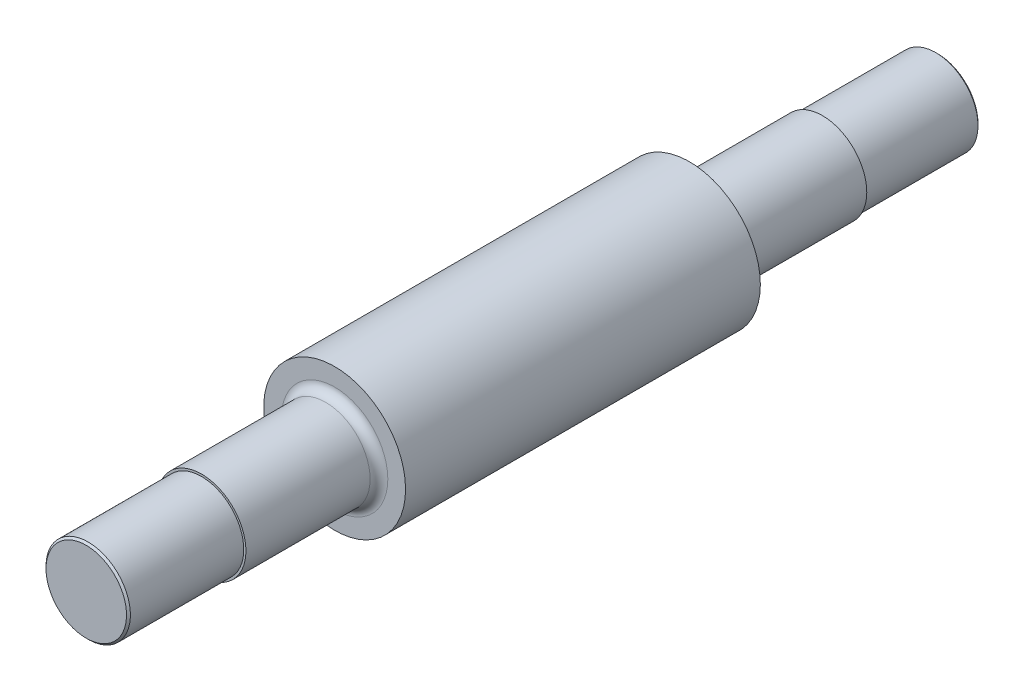
ISO-10303-21;
HEADER;
FILE_DESCRIPTION(('STEP AP214'),'2;1');
FILE_NAME('part.step','',(''),(''),'','','');
FILE_SCHEMA(('AUTOMOTIVE_DESIGN { 1 0 10303 214 1 1 1 1 }'));
ENDSEC;
DATA;
#1=APPLICATION_CONTEXT('core data for automotive mechanical design processes');
#2=APPLICATION_PROTOCOL_DEFINITION('international standard','automotive_design',2000,#1);
#3=PRODUCT_CONTEXT('',#1,'mechanical');
#4=PRODUCT('Part','Part','',(#3));
#5=PRODUCT_RELATED_PRODUCT_CATEGORY('part','',(#4));
#6=PRODUCT_DEFINITION_FORMATION('','',#4);
#7=PRODUCT_DEFINITION_CONTEXT('part definition',#1,'design');
#8=PRODUCT_DEFINITION('design','',#6,#7);
#9=PRODUCT_DEFINITION_SHAPE('','',#8);
#10=(LENGTH_UNIT() NAMED_UNIT(*) SI_UNIT(.MILLI.,.METRE.));
#11=(NAMED_UNIT(*) PLANE_ANGLE_UNIT() SI_UNIT($,.RADIAN.));
#12=(NAMED_UNIT(*) SI_UNIT($,.STERADIAN.) SOLID_ANGLE_UNIT());
#13=UNCERTAINTY_MEASURE_WITH_UNIT(LENGTH_MEASURE(1.E-05),#10,'distance_accuracy_value','');
#14=(GEOMETRIC_REPRESENTATION_CONTEXT(3) GLOBAL_UNCERTAINTY_ASSIGNED_CONTEXT((#13)) GLOBAL_UNIT_ASSIGNED_CONTEXT((#10,
#11,#12)) REPRESENTATION_CONTEXT('',''));
#15=CARTESIAN_POINT('',(0.,0.,0.));
#16=DIRECTION('',(0.,0.,1.));
#17=DIRECTION('',(1.,0.,0.));
#18=AXIS2_PLACEMENT_3D('',#15,#16,#17);
#19=CARTESIAN_POINT('',(0.,0.,-28.));
#20=DIRECTION('',(0.,0.,1.));
#21=DIRECTION('',(1.,0.,0.));
#22=AXIS2_PLACEMENT_3D('',#19,#20,#21);
#23=CYLINDRICAL_SURFACE('',#22,5.);
#24=CARTESIAN_POINT('',(0.,0.,-15.));
#25=DIRECTION('',(0.,0.,1.));
#26=DIRECTION('',(1.,0.,0.));
#27=AXIS2_PLACEMENT_3D('',#24,#25,#26);
#28=CIRCLE('',#27,5.);
#29=CARTESIAN_POINT('',(5.,0.,-15.));
#30=VERTEX_POINT('',#29);
#31=EDGE_CURVE('E232',#30,#30,#28,.T.);
#32=ORIENTED_EDGE('',*,*,#31,.T.);
#33=EDGE_LOOP('',(#32));
#34=FACE_BOUND('',#33,.T.);
#35=CARTESIAN_POINT('',(-4.58257569495584,2.,-3.));
#36=CARTESIAN_POINT('',(-4.58256464470381,2.00000798036348,-2.94619414749741));
#37=CARTESIAN_POINT('',(-4.58352306077322,1.99782891366025,-2.89239433444236));
#38=CARTESIAN_POINT('',(-4.58729625417543,1.98915905973447,-2.7852287017453));
#39=CARTESIAN_POINT('',(-4.59011032448545,1.98266991468793,-2.73186272464398));
#40=CARTESIAN_POINT('',(-4.59749782920639,1.9654760367637,-2.62615317844122));
#41=CARTESIAN_POINT('',(-4.60206430717532,1.95478796820434,-2.57380641595598));
#42=CARTESIAN_POINT('',(-4.61280053296682,1.92931630190661,-2.47029922828555));
#43=CARTESIAN_POINT('',(-4.61897037865398,1.91453245417091,-2.41913887572284));
#44=CARTESIAN_POINT('',(-4.63959291248421,1.86426971793523,-2.26806414941804));
#45=CARTESIAN_POINT('',(-4.6561744915743,1.82284489460008,-2.17034576931025));
#46=CARTESIAN_POINT('',(-4.6931237076538,1.72548191592177,-1.98320441991737));
#47=CARTESIAN_POINT('',(-4.71349493864007,1.66952996336926,-1.89378944703834));
#48=CARTESIAN_POINT('',(-4.75700999402114,1.54131835736855,-1.72073760332577));
#49=CARTESIAN_POINT('',(-4.78024245635516,1.4683691399273,-1.63763278307977));
#50=CARTESIAN_POINT('',(-4.82612790548655,1.30969646176209,-1.48445972778927));
#51=CARTESIAN_POINT('',(-4.84878077249721,1.22397038499682,-1.41439416913425));
#52=CARTESIAN_POINT('',(-4.89203417106082,1.03800590808969,-1.28659360580435));
#53=CARTESIAN_POINT('',(-4.91251824543531,0.937327933050965,-1.22945519073807));
#54=CARTESIAN_POINT('',(-4.94803944125003,0.726824143246712,-1.13315592731136));
#55=CARTESIAN_POINT('',(-4.96307883544185,0.617002169026247,-1.09398757594833));
#56=CARTESIAN_POINT('',(-4.98538314653815,0.396967441295693,-1.03665879868943));
#57=CARTESIAN_POINT('',(-4.99298922547927,0.287031054523062,-1.01757304909434));
#58=CARTESIAN_POINT('',(-5.00080310201085,0.0652684304565179,-0.997971520054384));
#59=CARTESIAN_POINT('',(-5.0010135205303,-0.046557123284163,-0.997449161976468));
#60=CARTESIAN_POINT('',(-4.99421960045302,-0.262233376226782,-1.01448283915987));
#61=CARTESIAN_POINT('',(-4.98761985585461,-0.36617920250679,-1.03102504667401));
#62=CARTESIAN_POINT('',(-4.96849270441446,-0.569674786500928,-1.07999342705354));
#63=CARTESIAN_POINT('',(-4.95596496209929,-0.66922429507284,-1.11242049886861));
#64=CARTESIAN_POINT('',(-4.92596830598785,-0.862897539070293,-1.19263629642451));
#65=CARTESIAN_POINT('',(-4.90842774755848,-0.956916851366439,-1.24064924081046));
#66=CARTESIAN_POINT('',(-4.87014602008043,-1.13580746919776,-1.35046458859515));
#67=CARTESIAN_POINT('',(-4.84940372896448,-1.22067554984697,-1.41227182969058));
#68=CARTESIAN_POINT('',(-4.80521782746143,-1.38476339273627,-1.55264418025852));
#69=CARTESIAN_POINT('',(-4.78168627172884,-1.4632477030894,-1.63204247467003));
#70=CARTESIAN_POINT('',(-4.7356195058465,-1.60609926099478,-1.80298009514767));
#71=CARTESIAN_POINT('',(-4.71308475332783,-1.67046007709005,-1.89452492209426));
#72=CARTESIAN_POINT('',(-4.67095688856025,-1.78493657933605,-2.09047028402122));
#73=CARTESIAN_POINT('',(-4.65146702150583,-1.83458932217622,-2.19516483666021));
#74=CARTESIAN_POINT('',(-4.61886105059581,-1.91521298357264,-2.41236152442947));
#75=CARTESIAN_POINT('',(-4.60573367628738,-1.94621696002208,-2.52484944733829));
#76=CARTESIAN_POINT('',(-4.59208303529493,-1.9781058182572,-2.69874363415798));
#77=CARTESIAN_POINT('',(-4.58853437680526,-1.98630505165979,-2.75865754930133));
#78=CARTESIAN_POINT('',(-4.58377540314389,-1.99725282103812,-2.87903501899554));
#79=CARTESIAN_POINT('',(-4.58256364711745,-2.00000471568568,-2.93949821175783));
#80=CARTESIAN_POINT('',(-4.58257569495584,-2.,-3.));
#81=B_SPLINE_CURVE_WITH_KNOTS('',3,(#35,#36,#37,#38,#39,#40,#41,#42,#43,#44,#45,#46,#47,#48,#49,
#50,#51,#52,#53,#54,#55,#56,#57,#58,#59,#60,#61,#62,#63,#64,#65,#66,#67,#68,#69,#70,#71,#72,#73,
#74,#75,#76,#77,#78,#79,#80),.UNSPECIFIED.,.F.,.F.,(4,2,2,2,2,2,2,2,2,2,2,2,2,2,2,2,2,2,2,2,2,2,
4),(0.,0.161354853098823,0.322648263883206,0.483307911251879,0.643977367092303,
0.964683001739095,1.28569434942626,1.62318047995499,1.96073580539192,2.31162858925764,
2.66237473197323,2.9961387650427,3.32978451514656,3.64468915259535,3.95961161305655,
4.27928176927547,4.59906421133019,4.93981874675154,5.28072813203934,5.63144241548463,
5.98153315592125,6.16300192557814,6.34435877193561),.UNSPECIFIED.);
#82=CARTESIAN_POINT('',(-5.00000000000041,0.,-0.999999999998974));
#83=VERTEX_POINT('',#82);
#84=CARTESIAN_POINT('',(-4.58257569495584,-2.,-3.));
#85=VERTEX_POINT('',#84);
#86=EDGE_CURVE('E305',#83,#85,#81,.T.);
#87=ORIENTED_EDGE('',*,*,#86,.T.);
#88=DIRECTION('',(0.,0.,-1.));
#89=VECTOR('',#88,1.);
#90=CARTESIAN_POINT('',(-4.58257569495584,-2.,68.));
#91=LINE('',#90,#89);
#92=CARTESIAN_POINT('',(-4.58257569495584,-2.,-9.49999999999999));
#93=VERTEX_POINT('',#92);
#94=EDGE_CURVE('E126',#85,#93,#91,.T.);
#95=ORIENTED_EDGE('',*,*,#94,.T.);
#96=CARTESIAN_POINT('',(-4.58257569495584,-2.,-9.49999999999999));
#97=CARTESIAN_POINT('',(-4.58256464470381,-2.00000798036347,-9.55380585250259));
#98=CARTESIAN_POINT('',(-4.58352306077323,-1.99782891366025,-9.60760566555764));
#99=CARTESIAN_POINT('',(-4.58729625417543,-1.98915905973447,-9.7147712982547));
#100=CARTESIAN_POINT('',(-4.59011032448545,-1.98266991468792,-9.76813727535603));
#101=CARTESIAN_POINT('',(-4.59749782920639,-1.9654760367637,-9.87384682155879));
#102=CARTESIAN_POINT('',(-4.60206430717533,-1.95478796820434,-9.92619358404403));
#103=CARTESIAN_POINT('',(-4.61280053296682,-1.9293163019066,-10.0297007717145));
#104=CARTESIAN_POINT('',(-4.61897037865398,-1.9145324541709,-10.0808611242772));
#105=CARTESIAN_POINT('',(-4.63959291248421,-1.86426971793523,-10.231935850582));
#106=CARTESIAN_POINT('',(-4.6561744915743,-1.82284489460008,-10.3296542306898));
#107=CARTESIAN_POINT('',(-4.6931237076538,-1.72548191592176,-10.5167955800826));
#108=CARTESIAN_POINT('',(-4.71349493864007,-1.66952996336925,-10.6062105529617));
#109=CARTESIAN_POINT('',(-4.75700999402114,-1.54131835736854,-10.7792623966742));
#110=CARTESIAN_POINT('',(-4.78024245635516,-1.4683691399273,-10.8623672169202));
#111=CARTESIAN_POINT('',(-4.82612790548656,-1.30969646176208,-11.0155402722107));
#112=CARTESIAN_POINT('',(-4.84878077249721,-1.22397038499682,-11.0856058308657));
#113=CARTESIAN_POINT('',(-4.89203417106082,-1.03800590808969,-11.2134063941957));
#114=CARTESIAN_POINT('',(-4.91251824543531,-0.937327933050958,-11.2705448092619));
#115=CARTESIAN_POINT('',(-4.94803944125004,-0.726824143246706,-11.3668440726886));
#116=CARTESIAN_POINT('',(-4.96307883544185,-0.617002169026242,-11.4060124240517));
#117=CARTESIAN_POINT('',(-4.98538314653816,-0.39696744129569,-11.4633412013106));
#118=CARTESIAN_POINT('',(-4.99298922547927,-0.287031054523057,-11.4824269509057));
#119=CARTESIAN_POINT('',(-5.00080310201085,-0.0652684304565126,-11.5020284799456));
#120=CARTESIAN_POINT('',(-5.00101352053029,0.0465571232841679,-11.5025508380235));
#121=CARTESIAN_POINT('',(-4.99421960045302,0.262233376226784,-11.4855171608401));
#122=CARTESIAN_POINT('',(-4.98761985585461,0.366179202506789,-11.468974953326));
#123=CARTESIAN_POINT('',(-4.96849270441446,0.569674786500929,-11.4200065729465));
#124=CARTESIAN_POINT('',(-4.95596496209929,0.669224295072845,-11.3875795011314));
#125=CARTESIAN_POINT('',(-4.92596830598785,0.862897539070297,-11.3073637035755));
#126=CARTESIAN_POINT('',(-4.90842774755848,0.956916851366436,-11.2593507591895));
#127=CARTESIAN_POINT('',(-4.87014602008043,1.13580746919776,-11.1495354114048));
#128=CARTESIAN_POINT('',(-4.84940372896448,1.22067554984698,-11.0877281703094));
#129=CARTESIAN_POINT('',(-4.80521782746143,1.38476339273627,-10.9473558197415));
#130=CARTESIAN_POINT('',(-4.78168627172885,1.46324770308939,-10.86795752533));
#131=CARTESIAN_POINT('',(-4.7356195058465,1.60609926099478,-10.6970199048523));
#132=CARTESIAN_POINT('',(-4.71308475332783,1.67046007709006,-10.6054750779057));
#133=CARTESIAN_POINT('',(-4.67095688856024,1.78493657933606,-10.4095297159788));
#134=CARTESIAN_POINT('',(-4.65146702150583,1.83458932217622,-10.3048351633398));
#135=CARTESIAN_POINT('',(-4.61886105059581,1.91521298357264,-10.0876384755705));
#136=CARTESIAN_POINT('',(-4.60573367628738,1.94621696002208,-9.97515055266171));
#137=CARTESIAN_POINT('',(-4.59208303529492,1.9781058182572,-9.80125636584202));
#138=CARTESIAN_POINT('',(-4.58853437680526,1.9863050516598,-9.74134245069867));
#139=CARTESIAN_POINT('',(-4.58377540314388,1.99725282103812,-9.62096498100446));
#140=CARTESIAN_POINT('',(-4.58256364711744,2.00000471568568,-9.56050178824217));
#141=CARTESIAN_POINT('',(-4.58257569495584,2.,-9.49999999999999));
#142=B_SPLINE_CURVE_WITH_KNOTS('',3,(#96,#97,#98,#99,#100,#101,#102,#103,#104,#105,#106,#107,
#108,#109,#110,#111,#112,#113,#114,#115,#116,#117,#118,#119,#120,#121,#122,#123,#124,#125,#126,
#127,#128,#129,#130,#131,#132,#133,#134,#135,#136,#137,#138,#139,#140,#141),.UNSPECIFIED.,.F.,
.F.,(4,2,2,2,2,2,2,2,2,2,2,2,2,2,2,2,2,2,2,2,2,2,4),(0.,0.161354853098826,0.322648263883215,
0.48330791125189,0.643977367092316,0.964683001739101,1.28569434942626,1.62318047995499,
1.96073580539192,2.31162858925764,2.66237473197323,2.9961387650427,3.32978451514656,
3.64468915259536,3.95961161305655,4.27928176927547,4.59906421133019,4.93981874675153,
5.28072813203934,5.63144241548463,5.98153315592126,6.16300192557815,6.34435877193562),.UNSPECIFIED.);
#143=CARTESIAN_POINT('',(-4.58257569495584,2.,-9.49999999999999));
#144=VERTEX_POINT('',#143);
#145=EDGE_CURVE('E162',#93,#144,#142,.T.);
#146=ORIENTED_EDGE('',*,*,#145,.T.);
#147=DIRECTION('',(0.,0.,-1.));
#148=VECTOR('',#147,1.);
#149=CARTESIAN_POINT('',(-4.58257569495584,2.,68.));
#150=LINE('',#149,#148);
#151=CARTESIAN_POINT('',(-4.58257569495584,2.,-3.));
#152=VERTEX_POINT('',#151);
#153=EDGE_CURVE('E308',#144,#152,#150,.F.);
#154=ORIENTED_EDGE('',*,*,#153,.T.);
#155=EDGE_CURVE('E146',#152,#83,#81,.T.);
#156=ORIENTED_EDGE('',*,*,#155,.T.);
#157=CARTESIAN_POINT('',(0.,0.,-1.));
#158=DIRECTION('',(0.,0.,1.));
#159=DIRECTION('',(1.,0.,0.));
#160=AXIS2_PLACEMENT_3D('',#157,#158,#159);
#161=CIRCLE('',#160,5.);
#162=EDGE_CURVE('E247',#83,#83,#161,.F.);
#163=ORIENTED_EDGE('',*,*,#162,.T.);
#164=EDGE_LOOP('',(#87,#95,#146,#154,#156,#163));
#165=FACE_BOUND('',#164,.T.);
#166=ADVANCED_FACE('F51',(#34,#165),#23,.T.);
#167=CARTESIAN_POINT('',(0.,0.,40.));
#168=DIRECTION('',(0.,0.,-1.));
#169=DIRECTION('',(-1.,0.,0.));
#170=AXIS2_PLACEMENT_3D('',#167,#168,#169);
#171=CYLINDRICAL_SURFACE('',#170,8.);
#172=CARTESIAN_POINT('',(0.,0.,40.));
#173=DIRECTION('',(0.,0.,1.));
#174=DIRECTION('',(1.,0.,0.));
#175=AXIS2_PLACEMENT_3D('',#172,#173,#174);
#176=CIRCLE('',#175,8.);
#177=CARTESIAN_POINT('',(8.,0.,40.));
#178=VERTEX_POINT('',#177);
#179=EDGE_CURVE('E239',#178,#178,#176,.T.);
#180=ORIENTED_EDGE('',*,*,#179,.F.);
#181=EDGE_LOOP('',(#180));
#182=FACE_BOUND('',#181,.T.);
#183=CARTESIAN_POINT('',(0.,0.,0.));
#184=DIRECTION('',(0.,0.,1.));
#185=DIRECTION('',(1.,0.,0.));
#186=AXIS2_PLACEMENT_3D('',#183,#184,#185);
#187=CIRCLE('',#186,8.);
#188=CARTESIAN_POINT('',(8.,0.,0.));
#189=VERTEX_POINT('',#188);
#190=EDGE_CURVE('E238',#189,#189,#187,.T.);
#191=ORIENTED_EDGE('',*,*,#190,.T.);
#192=EDGE_LOOP('',(#191));
#193=FACE_BOUND('',#192,.T.);
#194=ADVANCED_FACE('F272',(#182,#193),#171,.T.);
#195=CARTESIAN_POINT('',(0.,0.,40.));
#196=DIRECTION('',(0.,0.,1.));
#197=DIRECTION('',(1.,0.,0.));
#198=AXIS2_PLACEMENT_3D('',#195,#196,#197);
#199=PLANE('',#198);
#200=CARTESIAN_POINT('',(0.,0.,40.));
#201=DIRECTION('',(0.,0.,1.));
#202=DIRECTION('',(1.,0.,0.));
#203=AXIS2_PLACEMENT_3D('',#200,#201,#202);
#204=CIRCLE('',#203,6.);
#205=CARTESIAN_POINT('',(6.,0.,40.));
#206=VERTEX_POINT('',#205);
#207=EDGE_CURVE('E13',#206,#206,#204,.F.);
#208=ORIENTED_EDGE('',*,*,#207,.T.);
#209=EDGE_LOOP('',(#208));
#210=FACE_BOUND('',#209,.T.);
#211=ORIENTED_EDGE('',*,*,#179,.T.);
#212=EDGE_LOOP('',(#211));
#213=FACE_BOUND('',#212,.T.);
#214=ADVANCED_FACE('F278',(#210,#213),#199,.T.);
#215=CARTESIAN_POINT('',(0.,0.,0.));
#216=DIRECTION('',(0.,0.,1.));
#217=DIRECTION('',(1.,0.,0.));
#218=AXIS2_PLACEMENT_3D('',#215,#216,#217);
#219=PLANE('',#218);
#220=CARTESIAN_POINT('',(0.,0.,0.));
#221=DIRECTION('',(0.,0.,1.));
#222=DIRECTION('',(1.,0.,0.));
#223=AXIS2_PLACEMENT_3D('',#220,#221,#222);
#224=CIRCLE('',#223,6.);
#225=CARTESIAN_POINT('',(6.,0.,0.));
#226=VERTEX_POINT('',#225);
#227=EDGE_CURVE('E242',#226,#226,#224,.T.);
#228=ORIENTED_EDGE('',*,*,#227,.T.);
#229=EDGE_LOOP('',(#228));
#230=FACE_BOUND('',#229,.T.);
#231=ORIENTED_EDGE('',*,*,#190,.F.);
#232=EDGE_LOOP('',(#231));
#233=FACE_BOUND('',#232,.T.);
#234=ADVANCED_FACE('F287',(#230,#233),#219,.F.);
#235=CARTESIAN_POINT('',(0.,0.,-1.));
#236=DIRECTION('',(0.,0.,1.));
#237=DIRECTION('',(1.,0.,0.));
#238=AXIS2_PLACEMENT_3D('',#235,#236,#237);
#239=TOROIDAL_SURFACE('',#238,6.,1.);
#240=ORIENTED_EDGE('',*,*,#162,.F.);
#241=EDGE_LOOP('',(#240));
#242=FACE_BOUND('',#241,.T.);
#243=ORIENTED_EDGE('',*,*,#227,.F.);
#244=EDGE_LOOP('',(#243));
#245=FACE_BOUND('',#244,.T.);
#246=ADVANCED_FACE('F284',(#242,#245),#239,.F.);
#247=CARTESIAN_POINT('',(0.,0.,-28.));
#248=DIRECTION('',(0.,0.,1.));
#249=DIRECTION('',(1.,0.,0.));
#250=AXIS2_PLACEMENT_3D('',#247,#248,#249);
#251=CYLINDRICAL_SURFACE('',#250,4.7565);
#252=CARTESIAN_POINT('',(0.,0.,-15.));
#253=DIRECTION('',(0.,0.,1.));
#254=DIRECTION('',(1.,0.,0.));
#255=AXIS2_PLACEMENT_3D('',#252,#253,#254);
#256=CIRCLE('',#255,4.7565);
#257=CARTESIAN_POINT('',(4.7565,0.,-15.));
#258=VERTEX_POINT('',#257);
#259=EDGE_CURVE('E235',#258,#258,#256,.T.);
#260=ORIENTED_EDGE('',*,*,#259,.F.);
#261=EDGE_LOOP('',(#260));
#262=FACE_BOUND('',#261,.T.);
#263=CARTESIAN_POINT('',(0.,0.,-27.7835));
#264=DIRECTION('',(0.,0.,1.));
#265=DIRECTION('',(1.,0.,0.));
#266=AXIS2_PLACEMENT_3D('',#263,#264,#265);
#267=CIRCLE('',#266,4.7565);
#268=CARTESIAN_POINT('',(4.7565,0.,-27.7835));
#269=VERTEX_POINT('',#268);
#270=EDGE_CURVE('E226',#269,#269,#267,.T.);
#271=ORIENTED_EDGE('',*,*,#270,.T.);
#272=EDGE_LOOP('',(#271));
#273=FACE_BOUND('',#272,.T.);
#274=ADVANCED_FACE('F286',(#262,#273),#251,.T.);
#275=CARTESIAN_POINT('',(4.7565,0.,-15.));
#276=DIRECTION('',(0.,0.,1.));
#277=DIRECTION('',(1.,0.,0.));
#278=AXIS2_PLACEMENT_3D('',#275,#276,#277);
#279=PLANE('',#278);
#280=ORIENTED_EDGE('',*,*,#31,.F.);
#281=EDGE_LOOP('',(#280));
#282=FACE_BOUND('',#281,.T.);
#283=ORIENTED_EDGE('',*,*,#259,.T.);
#284=EDGE_LOOP('',(#283));
#285=FACE_BOUND('',#284,.T.);
#286=ADVANCED_FACE('F293',(#282,#285),#279,.F.);
#287=CARTESIAN_POINT('',(0.,0.,-28.));
#288=DIRECTION('',(0.,0.,1.));
#289=DIRECTION('',(1.,0.,0.));
#290=AXIS2_PLACEMENT_3D('',#287,#288,#289);
#291=CONICAL_SURFACE('',#290,4.54,0.785398163397458);
#292=ORIENTED_EDGE('',*,*,#270,.F.);
#293=EDGE_LOOP('',(#292));
#294=FACE_BOUND('',#293,.T.);
#295=CARTESIAN_POINT('',(0.,0.,-28.));
#296=DIRECTION('',(0.,0.,1.));
#297=DIRECTION('',(1.,0.,0.));
#298=AXIS2_PLACEMENT_3D('',#295,#296,#297);
#299=CIRCLE('',#298,4.54);
#300=CARTESIAN_POINT('',(4.54,0.,-28.));
#301=VERTEX_POINT('',#300);
#302=EDGE_CURVE('E229',#301,#301,#299,.T.);
#303=ORIENTED_EDGE('',*,*,#302,.T.);
#304=EDGE_LOOP('',(#303));
#305=FACE_BOUND('',#304,.T.);
#306=ADVANCED_FACE('F429',(#294,#305),#291,.T.);
#307=CARTESIAN_POINT('',(0.,0.,-28.));
#308=DIRECTION('',(0.,0.,1.));
#309=DIRECTION('',(1.,0.,0.));
#310=AXIS2_PLACEMENT_3D('',#307,#308,#309);
#311=PLANE('',#310);
#312=ORIENTED_EDGE('',*,*,#302,.F.);
#313=EDGE_LOOP('',(#312));
#314=FACE_BOUND('',#313,.T.);
#315=ADVANCED_FACE('F283',(#314),#311,.F.);
#316=CARTESIAN_POINT('',(0.,0.,68.));
#317=DIRECTION('',(0.,0.,-1.));
#318=DIRECTION('',(-1.,0.,0.));
#319=AXIS2_PLACEMENT_3D('',#316,#317,#318);
#320=CYLINDRICAL_SURFACE('',#319,5.);
#321=CARTESIAN_POINT('',(0.,0.,41.));
#322=DIRECTION('',(0.,0.,1.));
#323=DIRECTION('',(1.,0.,0.));
#324=AXIS2_PLACEMENT_3D('',#321,#322,#323);
#325=CIRCLE('',#324,5.);
#326=CARTESIAN_POINT('',(-5.,0.,41.));
#327=VERTEX_POINT('',#326);
#328=EDGE_CURVE('E59',#327,#327,#325,.T.);
#329=ORIENTED_EDGE('',*,*,#328,.T.);
#330=CARTESIAN_POINT('',(-4.58257569495584,2.,43.));
#331=CARTESIAN_POINT('',(-4.58256464460308,2.00000798074523,42.9461940238355));
#332=CARTESIAN_POINT('',(-4.5835230651295,1.99782890382978,42.8923940870443));
#333=CARTESIAN_POINT('',(-4.58729627580301,1.98915900979768,42.7852282099733));
#334=CARTESIAN_POINT('',(-4.59011035891672,1.98266983488183,42.7318621122313));
#335=CARTESIAN_POINT('',(-4.59749787986371,1.96547591856769,42.6261525730948));
#336=CARTESIAN_POINT('',(-4.60206435314848,1.95478786090698,42.573805934586));
#337=CARTESIAN_POINT('',(-4.61280056153232,1.92931623236441,42.4702989911005));
#338=CARTESIAN_POINT('',(-4.61897039446206,1.91453241157164,42.4191387587211));
#339=CARTESIAN_POINT('',(-4.63959307095438,1.86426933982564,42.2680629908993));
#340=CARTESIAN_POINT('',(-4.65617487498139,1.82284398117317,42.1703435206959));
#341=CARTESIAN_POINT('',(-4.69312417766962,1.72548058075418,41.983202347924));
#342=CARTESIAN_POINT('',(-4.71349518347092,1.66952907500059,41.8937884485713));
#343=CARTESIAN_POINT('',(-4.7570083110682,1.54132349154179,41.7207443222275));
#344=CARTESIAN_POINT('',(-4.78023894977214,1.46838082176942,41.6376454238387));
#345=CARTESIAN_POINT('',(-4.82612446866979,1.30970879203936,41.4844702661194));
#346=CARTESIAN_POINT('',(-4.84877914100377,1.22397489043547,41.414398652177));
#347=CARTESIAN_POINT('',(-4.89204347548508,1.03796851354449,41.2865664650551));
#348=CARTESIAN_POINT('',(-4.91253558832281,0.937252664377247,41.2294081317264));
#349=CARTESIAN_POINT('',(-4.94805210037378,0.726721666691695,41.1331216614847));
#350=CARTESIAN_POINT('',(-4.96308334748397,0.616918127836967,41.0939709266237));
#351=CARTESIAN_POINT('',(-4.98282067135847,0.422275332869856,41.0432488055319));
#352=CARTESIAN_POINT('',(-4.98922385410562,0.338781376508086,41.0270702251343));
#353=CARTESIAN_POINT('',(-4.99781460343099,0.170200792783051,41.0054447841041));
#354=CARTESIAN_POINT('',(-5.00000264466038,0.0851143458337842,40.9999967151475));
#355=CARTESIAN_POINT('',(-4.99999665414215,-0.107681313204993,41.0000041557887));
#356=CARTESIAN_POINT('',(-4.99648695827206,-0.215407280577215,41.0087335946427));
#357=CARTESIAN_POINT('',(-4.98281350615419,-0.427680802252587,41.0433001258713));
#358=CARTESIAN_POINT('',(-4.97264475044557,-0.532225906679354,41.0691500720741));
#359=CARTESIAN_POINT('',(-4.94674560097181,-0.734934339641889,41.1368671956921));
#360=CARTESIAN_POINT('',(-4.93102931598793,-0.833113116469267,41.1786937624499));
#361=CARTESIAN_POINT('',(-4.89557588170001,-1.02102557669093,41.2769911120081));
#362=CARTESIAN_POINT('',(-4.87583812376991,-1.11075797876765,41.3334641118126));
#363=CARTESIAN_POINT('',(-4.83330843124055,-1.28350336426502,41.4622367521218));
#364=CARTESIAN_POINT('',(-4.81042207341105,-1.36606584613657,41.5351092037745));
#365=CARTESIAN_POINT('',(-4.76460467541499,-1.51817804014667,41.6934043339332));
#366=CARTESIAN_POINT('',(-4.74167361991138,-1.58772195306072,41.7788325754105));
#367=CARTESIAN_POINT('',(-4.69721845761247,-1.71490216816058,41.9644667025326));
#368=CARTESIAN_POINT('',(-4.67580402804855,-1.77186217229292,42.0651644452119));
#369=CARTESIAN_POINT('',(-4.63832101022988,-1.86779093367616,42.2756413695513));
#370=CARTESIAN_POINT('',(-4.62224529256994,-1.906783711862,42.3854081934376));
#371=CARTESIAN_POINT('',(-4.60110666869269,-1.95713137456958,42.5796063560612));
#372=CARTESIAN_POINT('',(-4.59422807075555,-1.9731461187691,42.6626564553099));
#373=CARTESIAN_POINT('',(-4.58493016864862,-1.99460561120647,42.8304448311072));
#374=CARTESIAN_POINT('',(-4.58251587008298,-2.0000384948766,42.915184895098));
#375=CARTESIAN_POINT('',(-4.58257569495584,-2.,43.));
#376=B_SPLINE_CURVE_WITH_KNOTS('',3,(#330,#331,#332,#333,#334,#335,#336,#337,#338,#339,#340,
#341,#342,#343,#344,#345,#346,#347,#348,#349,#350,#351,#352,#353,#354,#355,#356,#357,#358,#359,
#360,#361,#362,#363,#364,#365,#366,#367,#368,#369,#370,#371,#372,#373,#374,#375),.UNSPECIFIED.,
.F.,.F.,(4,2,2,2,2,2,2,2,2,2,2,2,2,2,2,2,2,2,2,2,2,2,4),(0.,0.161355223890502,0.322649004679298,
0.483308283322214,0.643977367062374,0.9646866945518,1.28569434882197,1.62315502394645,
1.96073580403938,2.31177614925888,2.66237475977223,2.91749088649069,3.17257828386526,
3.49529880368199,3.81826189245767,4.14040945265619,4.46260580424014,4.79855936163858,
5.13466221793406,5.4858828410089,5.83663253426734,6.09045371289728,6.34455931683459),.UNSPECIFIED.);
#377=CARTESIAN_POINT('',(-4.58257569495584,2.,43.));
#378=VERTEX_POINT('',#377);
#379=EDGE_CURVE('E199',#378,#327,#376,.T.);
#380=ORIENTED_EDGE('',*,*,#379,.F.);
#381=DIRECTION('',(0.,0.,-1.));
#382=VECTOR('',#381,1.);
#383=CARTESIAN_POINT('',(-4.58257569495584,2.,68.));
#384=LINE('',#383,#382);
#385=CARTESIAN_POINT('',(-4.58257569495584,2.,49.5));
#386=VERTEX_POINT('',#385);
#387=EDGE_CURVE('E166',#386,#378,#384,.T.);
#388=ORIENTED_EDGE('',*,*,#387,.F.);
#389=CARTESIAN_POINT('',(-4.58257569495584,-2.,49.5));
#390=CARTESIAN_POINT('',(-4.58256464470381,-2.00000798036348,49.5538058525026));
#391=CARTESIAN_POINT('',(-4.58352306077323,-1.99782891366025,49.6076056655576));
#392=CARTESIAN_POINT('',(-4.58729625417543,-1.98915905973447,49.7147712982547));
#393=CARTESIAN_POINT('',(-4.59011032448545,-1.98266991468793,49.768137275356));
#394=CARTESIAN_POINT('',(-4.59749782920639,-1.9654760367637,49.8738468215588));
#395=CARTESIAN_POINT('',(-4.60206430717533,-1.95478796820434,49.926193584044));
#396=CARTESIAN_POINT('',(-4.61280053296682,-1.92931630190661,50.0297007717145));
#397=CARTESIAN_POINT('',(-4.61897037865398,-1.9145324541709,50.0808611242772));
#398=CARTESIAN_POINT('',(-4.63959291248421,-1.86426971793522,50.231935850582));
#399=CARTESIAN_POINT('',(-4.6561744915743,-1.82284489460008,50.3296542306898));
#400=CARTESIAN_POINT('',(-4.6931237076538,-1.72548191592176,50.5167955800826));
#401=CARTESIAN_POINT('',(-4.71349493864007,-1.66952996336926,50.6062105529617));
#402=CARTESIAN_POINT('',(-4.75700999402114,-1.54131835736854,50.7792623966742));
#403=CARTESIAN_POINT('',(-4.78024245635516,-1.46836913992729,50.8623672169202));
#404=CARTESIAN_POINT('',(-4.82612790548656,-1.30969646176208,51.0155402722107));
#405=CARTESIAN_POINT('',(-4.84878077249721,-1.22397038499681,51.0856058308658));
#406=CARTESIAN_POINT('',(-4.89203417106082,-1.03800590808969,51.2134063941957));
#407=CARTESIAN_POINT('',(-4.91251824543531,-0.937327933050956,51.2705448092619));
#408=CARTESIAN_POINT('',(-4.94803944125004,-0.726824143246703,51.3668440726887));
#409=CARTESIAN_POINT('',(-4.96307883544185,-0.61700216902624,51.4060124240517));
#410=CARTESIAN_POINT('',(-4.98538314653816,-0.396967441295687,51.4633412013106));
#411=CARTESIAN_POINT('',(-4.99298922547927,-0.287031054523054,51.4824269509057));
#412=CARTESIAN_POINT('',(-5.00080310201085,-0.0652684304565101,51.5020284799456));
#413=CARTESIAN_POINT('',(-5.00101352053029,0.0465571232841694,51.5025508380235));
#414=CARTESIAN_POINT('',(-4.99421960045302,0.262233376226789,51.4855171608401));
#415=CARTESIAN_POINT('',(-4.98761985585461,0.366179202506798,51.468974953326));
#416=CARTESIAN_POINT('',(-4.96849270441446,0.569674786500936,51.4200065729465));
#417=CARTESIAN_POINT('',(-4.95596496209929,0.669224295072847,51.3875795011314));
#418=CARTESIAN_POINT('',(-4.92596830598785,0.862897539070299,51.3073637035755));
#419=CARTESIAN_POINT('',(-4.90842774755847,0.956916851366445,51.2593507591895));
#420=CARTESIAN_POINT('',(-4.87014602008043,1.13580746919777,51.1495354114049));
#421=CARTESIAN_POINT('',(-4.84940372896448,1.22067554984698,51.0877281703094));
#422=CARTESIAN_POINT('',(-4.80521782746143,1.38476339273627,50.9473558197415));
#423=CARTESIAN_POINT('',(-4.78168627172884,1.4632477030894,50.86795752533));
#424=CARTESIAN_POINT('',(-4.7356195058465,1.60609926099478,50.6970199048523));
#425=CARTESIAN_POINT('',(-4.71308475332783,1.67046007709006,50.6054750779057));
#426=CARTESIAN_POINT('',(-4.67095688856024,1.78493657933606,50.4095297159788));
#427=CARTESIAN_POINT('',(-4.65146702150583,1.83458932217623,50.3048351633398));
#428=CARTESIAN_POINT('',(-4.61886105059581,1.91521298357265,50.0876384755705));
#429=CARTESIAN_POINT('',(-4.60573367628737,1.94621696002208,49.9751505526617));
#430=CARTESIAN_POINT('',(-4.59208303529492,1.9781058182572,49.801256365842));
#431=CARTESIAN_POINT('',(-4.58853437680526,1.9863050516598,49.7413424506987));
#432=CARTESIAN_POINT('',(-4.58377540314388,1.99725282103812,49.6209649810045));
#433=CARTESIAN_POINT('',(-4.58256364711744,2.00000471568569,49.5605017882422));
#434=CARTESIAN_POINT('',(-4.58257569495584,2.,49.5));
#435=B_SPLINE_CURVE_WITH_KNOTS('',3,(#389,#390,#391,#392,#393,#394,#395,#396,#397,#398,#399,
#400,#401,#402,#403,#404,#405,#406,#407,#408,#409,#410,#411,#412,#413,#414,#415,#416,#417,#418,
#419,#420,#421,#422,#423,#424,#425,#426,#427,#428,#429,#430,#431,#432,#433,#434),.UNSPECIFIED.,
.F.,.F.,(4,2,2,2,2,2,2,2,2,2,2,2,2,2,2,2,2,2,2,2,2,2,4),(0.,0.161354853098824,0.322648263883201,
0.483307911251876,0.643977367092303,0.9646830017391,1.28569434942627,1.62318047995499,
1.96073580539192,2.31162858925765,2.66237473197324,2.99613876504271,3.32978451514656,
3.64468915259536,3.95961161305656,4.27928176927548,4.59906421133019,4.93981874675154,
5.28072813203936,5.63144241548464,5.98153315592126,6.16300192557815,6.34435877193561),.UNSPECIFIED.);
#436=CARTESIAN_POINT('',(-4.58257569495584,-2.,49.5));
#437=VERTEX_POINT('',#436);
#438=EDGE_CURVE('E74',#437,#386,#435,.T.);
#439=ORIENTED_EDGE('',*,*,#438,.F.);
#440=DIRECTION('',(0.,0.,-1.));
#441=VECTOR('',#440,1.);
#442=CARTESIAN_POINT('',(-4.58257569495584,-2.,68.));
#443=LINE('',#442,#441);
#444=CARTESIAN_POINT('',(-4.58257569495584,-2.,43.));
#445=VERTEX_POINT('',#444);
#446=EDGE_CURVE('E185',#445,#437,#443,.F.);
#447=ORIENTED_EDGE('',*,*,#446,.F.);
#448=EDGE_CURVE('E205',#327,#445,#376,.T.);
#449=ORIENTED_EDGE('',*,*,#448,.F.);
#450=EDGE_LOOP('',(#329,#380,#388,#439,#447,#449));
#451=FACE_BOUND('',#450,.T.);
#452=CARTESIAN_POINT('',(0.,0.,55.));
#453=DIRECTION('',(0.,0.,-1.));
#454=DIRECTION('',(-1.,0.,0.));
#455=AXIS2_PLACEMENT_3D('',#452,#453,#454);
#456=CIRCLE('',#455,5.);
#457=CARTESIAN_POINT('',(-5.,0.,55.));
#458=VERTEX_POINT('',#457);
#459=EDGE_CURVE('E220',#458,#458,#456,.T.);
#460=ORIENTED_EDGE('',*,*,#459,.T.);
#461=EDGE_LOOP('',(#460));
#462=FACE_BOUND('',#461,.T.);
#463=ADVANCED_FACE('F254',(#451,#462),#320,.T.);
#464=CARTESIAN_POINT('',(0.,0.,68.));
#465=DIRECTION('',(0.,0.,-1.));
#466=DIRECTION('',(-1.,0.,0.));
#467=AXIS2_PLACEMENT_3D('',#464,#465,#466);
#468=CYLINDRICAL_SURFACE('',#467,4.7565);
#469=CARTESIAN_POINT('',(0.,0.,55.));
#470=DIRECTION('',(0.,0.,-1.));
#471=DIRECTION('',(-1.,0.,0.));
#472=AXIS2_PLACEMENT_3D('',#469,#470,#471);
#473=CIRCLE('',#472,4.7565);
#474=CARTESIAN_POINT('',(-4.7565,0.,55.));
#475=VERTEX_POINT('',#474);
#476=EDGE_CURVE('E223',#475,#475,#473,.T.);
#477=ORIENTED_EDGE('',*,*,#476,.F.);
#478=EDGE_LOOP('',(#477));
#479=FACE_BOUND('',#478,.T.);
#480=CARTESIAN_POINT('',(0.,0.,67.7835));
#481=DIRECTION('',(0.,0.,-1.));
#482=DIRECTION('',(-1.,0.,0.));
#483=AXIS2_PLACEMENT_3D('',#480,#481,#482);
#484=CIRCLE('',#483,4.7565);
#485=CARTESIAN_POINT('',(-4.7565,0.,67.7835));
#486=VERTEX_POINT('',#485);
#487=EDGE_CURVE('E184',#486,#486,#484,.T.);
#488=ORIENTED_EDGE('',*,*,#487,.T.);
#489=EDGE_LOOP('',(#488));
#490=FACE_BOUND('',#489,.T.);
#491=ADVANCED_FACE('F407',(#479,#490),#468,.T.);
#492=CARTESIAN_POINT('',(4.7565,0.,55.));
#493=DIRECTION('',(0.,0.,-1.));
#494=DIRECTION('',(-1.,0.,0.));
#495=AXIS2_PLACEMENT_3D('',#492,#493,#494);
#496=PLANE('',#495);
#497=ORIENTED_EDGE('',*,*,#459,.F.);
#498=EDGE_LOOP('',(#497));
#499=FACE_BOUND('',#498,.T.);
#500=ORIENTED_EDGE('',*,*,#476,.T.);
#501=EDGE_LOOP('',(#500));
#502=FACE_BOUND('',#501,.T.);
#503=ADVANCED_FACE('F398',(#499,#502),#496,.F.);
#504=CARTESIAN_POINT('',(0.,0.,68.));
#505=DIRECTION('',(0.,0.,-1.));
#506=DIRECTION('',(-1.,0.,0.));
#507=AXIS2_PLACEMENT_3D('',#504,#505,#506);
#508=CONICAL_SURFACE('',#507,4.54,0.785398163397458);
#509=ORIENTED_EDGE('',*,*,#487,.F.);
#510=EDGE_LOOP('',(#509));
#511=FACE_BOUND('',#510,.T.);
#512=CARTESIAN_POINT('',(0.,0.,68.));
#513=DIRECTION('',(0.,0.,-1.));
#514=DIRECTION('',(-1.,0.,0.));
#515=AXIS2_PLACEMENT_3D('',#512,#513,#514);
#516=CIRCLE('',#515,4.54);
#517=CARTESIAN_POINT('',(-4.54,0.,68.));
#518=VERTEX_POINT('',#517);
#519=EDGE_CURVE('E217',#518,#518,#516,.T.);
#520=ORIENTED_EDGE('',*,*,#519,.T.);
#521=EDGE_LOOP('',(#520));
#522=FACE_BOUND('',#521,.T.);
#523=ADVANCED_FACE('F196',(#511,#522),#508,.T.);
#524=CARTESIAN_POINT('',(0.,0.,68.));
#525=DIRECTION('',(0.,0.,-1.));
#526=DIRECTION('',(1.,0.,0.));
#527=AXIS2_PLACEMENT_3D('',#524,#525,#526);
#528=PLANE('',#527);
#529=ORIENTED_EDGE('',*,*,#519,.F.);
#530=EDGE_LOOP('',(#529));
#531=FACE_BOUND('',#530,.T.);
#532=ADVANCED_FACE('F260',(#531),#528,.F.);
#533=CARTESIAN_POINT('',(0.,0.,41.));
#534=DIRECTION('',(0.,0.,1.));
#535=DIRECTION('',(1.,0.,0.));
#536=AXIS2_PLACEMENT_3D('',#533,#534,#535);
#537=TOROIDAL_SURFACE('',#536,6.,1.);
#538=ORIENTED_EDGE('',*,*,#207,.F.);
#539=EDGE_LOOP('',(#538));
#540=FACE_BOUND('',#539,.T.);
#541=ORIENTED_EDGE('',*,*,#328,.F.);
#542=EDGE_LOOP('',(#541));
#543=FACE_BOUND('',#542,.T.);
#544=ADVANCED_FACE('F53',(#540,#543),#537,.F.);
#545=CARTESIAN_POINT('',(-8.001,0.,43.));
#546=DIRECTION('',(1.,0.,0.));
#547=DIRECTION('',(0.,0.,-1.));
#548=AXIS2_PLACEMENT_3D('',#545,#546,#547);
#549=CYLINDRICAL_SURFACE('',#548,2.);
#550=ORIENTED_EDGE('',*,*,#379,.T.);
#551=ORIENTED_EDGE('',*,*,#448,.T.);
#552=DIRECTION('',(1.,0.,0.));
#553=VECTOR('',#552,1.);
#554=CARTESIAN_POINT('',(-8.001,-2.,43.));
#555=LINE('',#554,#553);
#556=CARTESIAN_POINT('',(-3.,-2.,43.));
#557=VERTEX_POINT('',#556);
#558=EDGE_CURVE('E208',#445,#557,#555,.T.);
#559=ORIENTED_EDGE('',*,*,#558,.T.);
#560=CARTESIAN_POINT('',(-3.,0.,43.));
#561=DIRECTION('',(1.,0.,0.));
#562=DIRECTION('',(0.,0.,-1.));
#563=AXIS2_PLACEMENT_3D('',#560,#561,#562);
#564=CIRCLE('',#563,2.);
#565=CARTESIAN_POINT('',(-3.,2.,43.));
#566=VERTEX_POINT('',#565);
#567=EDGE_CURVE('E173',#557,#566,#564,.T.);
#568=ORIENTED_EDGE('',*,*,#567,.T.);
#569=DIRECTION('',(1.,0.,0.));
#570=VECTOR('',#569,1.);
#571=CARTESIAN_POINT('',(-8.001,2.,43.));
#572=LINE('',#571,#570);
#573=EDGE_CURVE('E211',#378,#566,#572,.T.);
#574=ORIENTED_EDGE('',*,*,#573,.F.);
#575=EDGE_LOOP('',(#550,#551,#559,#568,#574));
#576=FACE_BOUND('',#575,.T.);
#577=ADVANCED_FACE('F194',(#576),#549,.F.);
#578=CARTESIAN_POINT('',(-8.001,-2.,49.5));
#579=DIRECTION('',(0.,-1.,0.));
#580=DIRECTION('',(0.,0.,-1.));
#581=AXIS2_PLACEMENT_3D('',#578,#579,#580);
#582=PLANE('',#581);
#583=ORIENTED_EDGE('',*,*,#446,.T.);
#584=DIRECTION('',(1.,0.,0.));
#585=VECTOR('',#584,1.);
#586=CARTESIAN_POINT('',(-8.001,-2.,49.5));
#587=LINE('',#586,#585);
#588=CARTESIAN_POINT('',(-3.,-2.,49.5));
#589=VERTEX_POINT('',#588);
#590=EDGE_CURVE('E210',#437,#589,#587,.T.);
#591=ORIENTED_EDGE('',*,*,#590,.T.);
#592=DIRECTION('',(0.,0.,-1.));
#593=VECTOR('',#592,1.);
#594=CARTESIAN_POINT('',(-3.,-2.,49.5));
#595=LINE('',#594,#593);
#596=EDGE_CURVE('E163',#589,#557,#595,.T.);
#597=ORIENTED_EDGE('',*,*,#596,.T.);
#598=ORIENTED_EDGE('',*,*,#558,.F.);
#599=EDGE_LOOP('',(#583,#591,#597,#598));
#600=FACE_BOUND('',#599,.T.);
#601=ADVANCED_FACE('F266',(#600),#582,.F.);
#602=CARTESIAN_POINT('',(-8.001,0.,49.5));
#603=DIRECTION('',(1.,0.,0.));
#604=DIRECTION('',(0.,0.,-1.));
#605=AXIS2_PLACEMENT_3D('',#602,#603,#604);
#606=CYLINDRICAL_SURFACE('',#605,2.);
#607=ORIENTED_EDGE('',*,*,#438,.T.);
#608=DIRECTION('',(1.,0.,0.));
#609=VECTOR('',#608,1.);
#610=CARTESIAN_POINT('',(-8.001,2.,49.5));
#611=LINE('',#610,#609);
#612=CARTESIAN_POINT('',(-3.,2.,49.5));
#613=VERTEX_POINT('',#612);
#614=EDGE_CURVE('E176',#386,#613,#611,.T.);
#615=ORIENTED_EDGE('',*,*,#614,.T.);
#616=CARTESIAN_POINT('',(-3.,0.,49.5));
#617=DIRECTION('',(1.,0.,0.));
#618=DIRECTION('',(0.,0.,-1.));
#619=AXIS2_PLACEMENT_3D('',#616,#617,#618);
#620=CIRCLE('',#619,2.);
#621=EDGE_CURVE('E167',#613,#589,#620,.T.);
#622=ORIENTED_EDGE('',*,*,#621,.T.);
#623=ORIENTED_EDGE('',*,*,#590,.F.);
#624=EDGE_LOOP('',(#607,#615,#622,#623));
#625=FACE_BOUND('',#624,.T.);
#626=ADVANCED_FACE('F187',(#625),#606,.F.);
#627=CARTESIAN_POINT('',(-8.001,2.,49.5));
#628=DIRECTION('',(0.,1.,0.));
#629=DIRECTION('',(0.,0.,1.));
#630=AXIS2_PLACEMENT_3D('',#627,#628,#629);
#631=PLANE('',#630);
#632=ORIENTED_EDGE('',*,*,#387,.T.);
#633=ORIENTED_EDGE('',*,*,#573,.T.);
#634=DIRECTION('',(0.,0.,1.));
#635=VECTOR('',#634,1.);
#636=CARTESIAN_POINT('',(-3.,2.,49.5));
#637=LINE('',#636,#635);
#638=EDGE_CURVE('E170',#566,#613,#637,.T.);
#639=ORIENTED_EDGE('',*,*,#638,.T.);
#640=ORIENTED_EDGE('',*,*,#614,.F.);
#641=EDGE_LOOP('',(#632,#633,#639,#640));
#642=FACE_BOUND('',#641,.T.);
#643=ADVANCED_FACE('F341',(#642),#631,.F.);
#644=CARTESIAN_POINT('',(-3.,0.,43.));
#645=DIRECTION('',(1.,0.,0.));
#646=DIRECTION('',(0.,0.,-1.));
#647=AXIS2_PLACEMENT_3D('',#644,#645,#646);
#648=PLANE('',#647);
#649=ORIENTED_EDGE('',*,*,#567,.F.);
#650=ORIENTED_EDGE('',*,*,#596,.F.);
#651=ORIENTED_EDGE('',*,*,#621,.F.);
#652=ORIENTED_EDGE('',*,*,#638,.F.);
#653=EDGE_LOOP('',(#649,#650,#651,#652));
#654=FACE_BOUND('',#653,.T.);
#655=ADVANCED_FACE('F323',(#654),#648,.F.);
#656=CARTESIAN_POINT('',(-3.,0.,-3.));
#657=DIRECTION('',(1.,0.,0.));
#658=DIRECTION('',(0.,0.,1.));
#659=AXIS2_PLACEMENT_3D('',#656,#657,#658);
#660=PLANE('',#659);
#661=CARTESIAN_POINT('',(-3.,0.,-3.));
#662=DIRECTION('',(-1.,0.,0.));
#663=DIRECTION('',(0.,0.,1.));
#664=AXIS2_PLACEMENT_3D('',#661,#662,#663);
#665=CIRCLE('',#664,2.);
#666=CARTESIAN_POINT('',(-3.,-2.,-3.));
#667=VERTEX_POINT('',#666);
#668=CARTESIAN_POINT('',(-3.,2.,-3.));
#669=VERTEX_POINT('',#668);
#670=EDGE_CURVE('E136',#667,#669,#665,.T.);
#671=ORIENTED_EDGE('',*,*,#670,.T.);
#672=DIRECTION('',(0.,0.,-1.));
#673=VECTOR('',#672,1.);
#674=CARTESIAN_POINT('',(-3.,2.,-9.49999999999999));
#675=LINE('',#674,#673);
#676=CARTESIAN_POINT('',(-3.,2.,-9.49999999999999));
#677=VERTEX_POINT('',#676);
#678=EDGE_CURVE('E129',#669,#677,#675,.T.);
#679=ORIENTED_EDGE('',*,*,#678,.T.);
#680=CARTESIAN_POINT('',(-3.,0.,-9.49999999999999));
#681=DIRECTION('',(-1.,0.,0.));
#682=DIRECTION('',(0.,0.,1.));
#683=AXIS2_PLACEMENT_3D('',#680,#681,#682);
#684=CIRCLE('',#683,2.);
#685=CARTESIAN_POINT('',(-3.,-2.,-9.49999999999999));
#686=VERTEX_POINT('',#685);
#687=EDGE_CURVE('E138',#677,#686,#684,.T.);
#688=ORIENTED_EDGE('',*,*,#687,.T.);
#689=DIRECTION('',(0.,0.,1.));
#690=VECTOR('',#689,1.);
#691=CARTESIAN_POINT('',(-3.,-2.,-9.49999999999999));
#692=LINE('',#691,#690);
#693=EDGE_CURVE('E124',#686,#667,#692,.T.);
#694=ORIENTED_EDGE('',*,*,#693,.T.);
#695=EDGE_LOOP('',(#671,#679,#688,#694));
#696=FACE_BOUND('',#695,.T.);
#697=ADVANCED_FACE('F134',(#696),#660,.F.);
#698=CARTESIAN_POINT('',(-8.001,-2.,-9.49999999999999));
#699=DIRECTION('',(0.,1.,0.));
#700=DIRECTION('',(0.,0.,1.));
#701=AXIS2_PLACEMENT_3D('',#698,#699,#700);
#702=PLANE('',#701);
#703=DIRECTION('',(1.,0.,0.));
#704=VECTOR('',#703,1.);
#705=CARTESIAN_POINT('',(-8.001,-2.,-3.));
#706=LINE('',#705,#704);
#707=EDGE_CURVE('E66',#85,#667,#706,.T.);
#708=ORIENTED_EDGE('',*,*,#707,.T.);
#709=ORIENTED_EDGE('',*,*,#693,.F.);
#710=DIRECTION('',(1.,0.,0.));
#711=VECTOR('',#710,1.);
#712=CARTESIAN_POINT('',(-8.001,-2.,-9.49999999999999));
#713=LINE('',#712,#711);
#714=EDGE_CURVE('E128',#93,#686,#713,.T.);
#715=ORIENTED_EDGE('',*,*,#714,.F.);
#716=ORIENTED_EDGE('',*,*,#94,.F.);
#717=EDGE_LOOP('',(#708,#709,#715,#716));
#718=FACE_BOUND('',#717,.T.);
#719=ADVANCED_FACE('F122',(#718),#702,.T.);
#720=CARTESIAN_POINT('',(-8.001,0.,-9.49999999999999));
#721=DIRECTION('',(1.,0.,0.));
#722=DIRECTION('',(0.,0.,-1.));
#723=AXIS2_PLACEMENT_3D('',#720,#721,#722);
#724=CYLINDRICAL_SURFACE('',#723,2.);
#725=ORIENTED_EDGE('',*,*,#714,.T.);
#726=ORIENTED_EDGE('',*,*,#687,.F.);
#727=DIRECTION('',(1.,0.,0.));
#728=VECTOR('',#727,1.);
#729=CARTESIAN_POINT('',(-8.001,2.,-9.49999999999999));
#730=LINE('',#729,#728);
#731=EDGE_CURVE('E158',#144,#677,#730,.T.);
#732=ORIENTED_EDGE('',*,*,#731,.F.);
#733=ORIENTED_EDGE('',*,*,#145,.F.);
#734=EDGE_LOOP('',(#725,#726,#732,#733));
#735=FACE_BOUND('',#734,.T.);
#736=ADVANCED_FACE('F315',(#735),#724,.F.);
#737=CARTESIAN_POINT('',(-8.001,2.,-9.49999999999999));
#738=DIRECTION('',(0.,-1.,0.));
#739=DIRECTION('',(0.,0.,-1.));
#740=AXIS2_PLACEMENT_3D('',#737,#738,#739);
#741=PLANE('',#740);
#742=ORIENTED_EDGE('',*,*,#731,.T.);
#743=ORIENTED_EDGE('',*,*,#678,.F.);
#744=DIRECTION('',(1.,0.,0.));
#745=VECTOR('',#744,1.);
#746=CARTESIAN_POINT('',(-8.001,2.,-3.));
#747=LINE('',#746,#745);
#748=EDGE_CURVE('E142',#152,#669,#747,.T.);
#749=ORIENTED_EDGE('',*,*,#748,.F.);
#750=ORIENTED_EDGE('',*,*,#153,.F.);
#751=EDGE_LOOP('',(#742,#743,#749,#750));
#752=FACE_BOUND('',#751,.T.);
#753=ADVANCED_FACE('F324',(#752),#741,.T.);
#754=CARTESIAN_POINT('',(-8.001,0.,-3.));
#755=DIRECTION('',(1.,0.,0.));
#756=DIRECTION('',(0.,0.,-1.));
#757=AXIS2_PLACEMENT_3D('',#754,#755,#756);
#758=CYLINDRICAL_SURFACE('',#757,2.);
#759=ORIENTED_EDGE('',*,*,#748,.T.);
#760=ORIENTED_EDGE('',*,*,#670,.F.);
#761=ORIENTED_EDGE('',*,*,#707,.F.);
#762=ORIENTED_EDGE('',*,*,#86,.F.);
#763=ORIENTED_EDGE('',*,*,#155,.F.);
#764=EDGE_LOOP('',(#759,#760,#761,#762,#763));
#765=FACE_BOUND('',#764,.T.);
#766=ADVANCED_FACE('F140',(#765),#758,.F.);
#767=CLOSED_SHELL('',(#166,#194,#214,#234,#246,#274,#286,#306,#315,#463,#491,#503,#523,#532,
#544,#577,#601,#626,#643,#655,#697,#719,#736,#753,#766));
#768=MANIFOLD_SOLID_BREP('B2',#767);
#769=ADVANCED_BREP_SHAPE_REPRESENTATION('',(#18,#768),#14);
#770=SHAPE_DEFINITION_REPRESENTATION(#9,#769);
ENDSEC;
END-ISO-10303-21;
